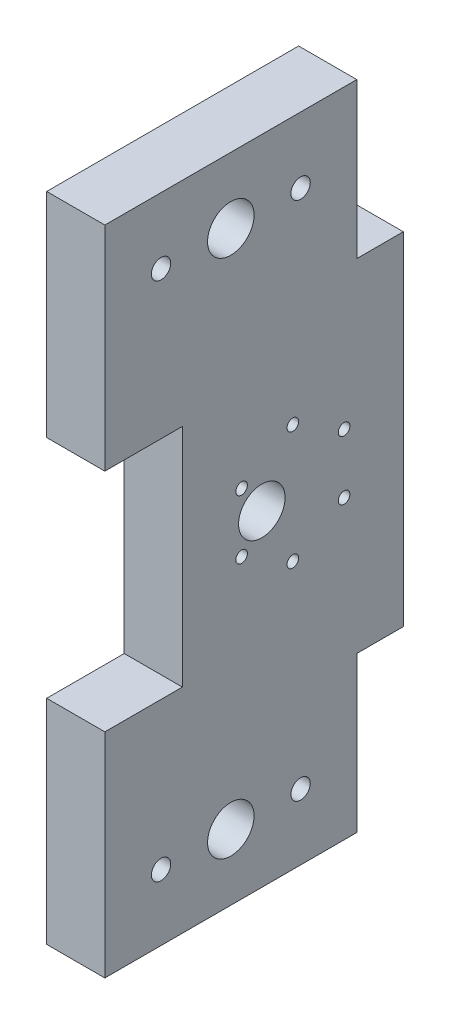
ISO-10303-21;
HEADER;
FILE_DESCRIPTION(('STEP AP214'),'2;1');
FILE_NAME('part.step','',(''),(''),'','','');
FILE_SCHEMA(('AUTOMOTIVE_DESIGN { 1 0 10303 214 1 1 1 1 }'));
ENDSEC;
DATA;
#1=APPLICATION_CONTEXT('core data for automotive mechanical design processes');
#2=APPLICATION_PROTOCOL_DEFINITION('international standard','automotive_design',2000,#1);
#3=PRODUCT_CONTEXT('',#1,'mechanical');
#4=PRODUCT('Part','Part','',(#3));
#5=PRODUCT_RELATED_PRODUCT_CATEGORY('part','',(#4));
#6=PRODUCT_DEFINITION_FORMATION('','',#4);
#7=PRODUCT_DEFINITION_CONTEXT('part definition',#1,'design');
#8=PRODUCT_DEFINITION('design','',#6,#7);
#9=PRODUCT_DEFINITION_SHAPE('','',#8);
#10=(LENGTH_UNIT() NAMED_UNIT(*) SI_UNIT(.MILLI.,.METRE.));
#11=(NAMED_UNIT(*) PLANE_ANGLE_UNIT() SI_UNIT($,.RADIAN.));
#12=(NAMED_UNIT(*) SI_UNIT($,.STERADIAN.) SOLID_ANGLE_UNIT());
#13=UNCERTAINTY_MEASURE_WITH_UNIT(LENGTH_MEASURE(1.E-05),#10,'distance_accuracy_value','');
#14=(GEOMETRIC_REPRESENTATION_CONTEXT(3) GLOBAL_UNCERTAINTY_ASSIGNED_CONTEXT((#13)) GLOBAL_UNIT_ASSIGNED_CONTEXT((#10,
#11,#12)) REPRESENTATION_CONTEXT('',''));
#15=CARTESIAN_POINT('',(0.,0.,0.));
#16=DIRECTION('',(0.,0.,1.));
#17=DIRECTION('',(1.,0.,0.));
#18=AXIS2_PLACEMENT_3D('',#15,#16,#17);
#19=CARTESIAN_POINT('',(0.,9.12000000000002,0.));
#20=DIRECTION('',(0.,1.,0.));
#21=DIRECTION('',(0.,0.,1.));
#22=AXIS2_PLACEMENT_3D('',#19,#20,#21);
#23=PLANE('',#22);
#24=DIRECTION('',(0.,0.,1.));
#25=VECTOR('',#24,1.);
#26=CARTESIAN_POINT('',(19.,9.12000000000001,-24.));
#27=LINE('',#26,#25);
#28=CARTESIAN_POINT('',(19.,9.12000000000001,-24.));
#29=VERTEX_POINT('',#28);
#30=CARTESIAN_POINT('',(19.,9.12000000000003,-12.));
#31=VERTEX_POINT('',#30);
#32=EDGE_CURVE('E212',#29,#31,#27,.T.);
#33=ORIENTED_EDGE('',*,*,#32,.T.);
#34=DIRECTION('',(1.,0.,0.));
#35=VECTOR('',#34,1.);
#36=CARTESIAN_POINT('',(19.,9.12000000000003,-12.));
#37=LINE('',#36,#35);
#38=CARTESIAN_POINT('',(34.,9.12000000000001,-12.));
#39=VERTEX_POINT('',#38);
#40=EDGE_CURVE('E157',#31,#39,#37,.T.);
#41=ORIENTED_EDGE('',*,*,#40,.T.);
#42=DIRECTION('',(0.,0.,-1.));
#43=VECTOR('',#42,1.);
#44=CARTESIAN_POINT('',(34.,9.12000000000001,-24.));
#45=LINE('',#44,#43);
#46=CARTESIAN_POINT('',(34.,9.12000000000001,-24.));
#47=VERTEX_POINT('',#46);
#48=EDGE_CURVE('E215',#39,#47,#45,.T.);
#49=ORIENTED_EDGE('',*,*,#48,.T.);
#50=DIRECTION('',(-1.,0.,0.));
#51=VECTOR('',#50,1.);
#52=CARTESIAN_POINT('',(19.,9.12000000000001,-24.));
#53=LINE('',#52,#51);
#54=EDGE_CURVE('E217',#47,#29,#53,.T.);
#55=ORIENTED_EDGE('',*,*,#54,.T.);
#56=EDGE_LOOP('',(#33,#41,#49,#55));
#57=FACE_BOUND('',#56,.T.);
#58=ADVANCED_FACE('F43',(#57),#23,.T.);
#59=CARTESIAN_POINT('',(19.,0.,33.));
#60=DIRECTION('',(0.,0.,1.));
#61=DIRECTION('',(0.,-1.,0.));
#62=AXIS2_PLACEMENT_3D('',#59,#60,#61);
#63=PLANE('',#62);
#64=DIRECTION('',(0.,-1.,0.));
#65=VECTOR('',#64,1.);
#66=CARTESIAN_POINT('',(19.,0.,33.));
#67=LINE('',#66,#65);
#68=CARTESIAN_POINT('',(19.,-5.87999999999998,33.));
#69=VERTEX_POINT('',#68);
#70=CARTESIAN_POINT('',(19.,-64.12,33.));
#71=VERTEX_POINT('',#70);
#72=EDGE_CURVE('E227',#69,#71,#67,.T.);
#73=ORIENTED_EDGE('',*,*,#72,.T.);
#74=DIRECTION('',(-1.,0.,0.));
#75=VECTOR('',#74,1.);
#76=CARTESIAN_POINT('',(19.,-64.12,33.));
#77=LINE('',#76,#75);
#78=CARTESIAN_POINT('',(34.,-64.12,33.));
#79=VERTEX_POINT('',#78);
#80=EDGE_CURVE('E197',#79,#71,#77,.T.);
#81=ORIENTED_EDGE('',*,*,#80,.F.);
#82=DIRECTION('',(0.,-1.,0.));
#83=VECTOR('',#82,1.);
#84=CARTESIAN_POINT('',(34.,0.,33.));
#85=LINE('',#84,#83);
#86=CARTESIAN_POINT('',(34.,-5.87999999999998,33.));
#87=VERTEX_POINT('',#86);
#88=EDGE_CURVE('E228',#87,#79,#85,.T.);
#89=ORIENTED_EDGE('',*,*,#88,.F.);
#90=DIRECTION('',(1.,0.,0.));
#91=VECTOR('',#90,1.);
#92=CARTESIAN_POINT('',(19.,-5.87999999999998,33.));
#93=LINE('',#92,#91);
#94=EDGE_CURVE('E148',#69,#87,#93,.T.);
#95=ORIENTED_EDGE('',*,*,#94,.F.);
#96=EDGE_LOOP('',(#73,#81,#89,#95));
#97=FACE_BOUND('',#96,.T.);
#98=ADVANCED_FACE('F293',(#97),#63,.T.);
#99=CARTESIAN_POINT('',(34.,-105.,25.));
#100=DIRECTION('',(-1.,0.,0.));
#101=DIRECTION('',(0.,0.,1.));
#102=AXIS2_PLACEMENT_3D('',#99,#100,#101);
#103=PLANE('',#102);
#104=CARTESIAN_POINT('',(34.,-102.12,2.50000000000001));
#105=DIRECTION('',(-1.,0.,0.));
#106=DIRECTION('',(0.,-1.,0.));
#107=AXIS2_PLACEMENT_3D('',#104,#105,#106);
#108=CIRCLE('',#107,2.5);
#109=CARTESIAN_POINT('',(34.,-104.62,2.50000000000001));
#110=VERTEX_POINT('',#109);
#111=EDGE_CURVE('E424',#110,#110,#108,.T.);
#112=ORIENTED_EDGE('',*,*,#111,.T.);
#113=EDGE_LOOP('',(#112));
#114=FACE_BOUND('',#113,.T.);
#115=CARTESIAN_POINT('',(34.,-102.12,38.5));
#116=DIRECTION('',(-1.,0.,0.));
#117=DIRECTION('',(0.,1.,0.));
#118=AXIS2_PLACEMENT_3D('',#115,#116,#117);
#119=CIRCLE('',#118,2.50000000000001);
#120=CARTESIAN_POINT('',(34.,-99.6199999999999,38.5));
#121=VERTEX_POINT('',#120);
#122=EDGE_CURVE('E430',#121,#121,#119,.T.);
#123=ORIENTED_EDGE('',*,*,#122,.T.);
#124=EDGE_LOOP('',(#123));
#125=FACE_BOUND('',#124,.T.);
#126=CARTESIAN_POINT('',(34.,32.12,38.5));
#127=DIRECTION('',(-1.,0.,0.));
#128=DIRECTION('',(0.,-1.,0.));
#129=AXIS2_PLACEMENT_3D('',#126,#127,#128);
#130=CIRCLE('',#129,2.50000000000001);
#131=CARTESIAN_POINT('',(34.,29.62,38.5));
#132=VERTEX_POINT('',#131);
#133=EDGE_CURVE('E436',#132,#132,#130,.T.);
#134=ORIENTED_EDGE('',*,*,#133,.T.);
#135=EDGE_LOOP('',(#134));
#136=FACE_BOUND('',#135,.T.);
#137=CARTESIAN_POINT('',(34.,32.12,20.5));
#138=DIRECTION('',(-1.,0.,0.));
#139=DIRECTION('',(0.,1.,0.));
#140=AXIS2_PLACEMENT_3D('',#137,#138,#139);
#141=CIRCLE('',#140,6.);
#142=CARTESIAN_POINT('',(34.,38.12,20.5));
#143=VERTEX_POINT('',#142);
#144=EDGE_CURVE('E413',#143,#143,#141,.T.);
#145=ORIENTED_EDGE('',*,*,#144,.T.);
#146=EDGE_LOOP('',(#145));
#147=FACE_BOUND('',#146,.T.);
#148=CARTESIAN_POINT('',(34.,32.12,2.49999999999998));
#149=DIRECTION('',(-1.,0.,0.));
#150=DIRECTION('',(0.,1.,0.));
#151=AXIS2_PLACEMENT_3D('',#148,#149,#150);
#152=CIRCLE('',#151,2.5);
#153=CARTESIAN_POINT('',(34.,34.62,2.49999999999998));
#154=VERTEX_POINT('',#153);
#155=EDGE_CURVE('E408',#154,#154,#152,.T.);
#156=ORIENTED_EDGE('',*,*,#155,.T.);
#157=EDGE_LOOP('',(#156));
#158=FACE_BOUND('',#157,.T.);
#159=CARTESIAN_POINT('',(34.,-102.12,20.5));
#160=DIRECTION('',(-1.,0.,0.));
#161=DIRECTION('',(0.,-1.,0.));
#162=AXIS2_PLACEMENT_3D('',#159,#160,#161);
#163=CIRCLE('',#162,6.);
#164=CARTESIAN_POINT('',(34.,-108.12,20.5));
#165=VERTEX_POINT('',#164);
#166=EDGE_CURVE('E170',#165,#165,#163,.T.);
#167=ORIENTED_EDGE('',*,*,#166,.T.);
#168=EDGE_LOOP('',(#167));
#169=FACE_BOUND('',#168,.T.);
#170=CARTESIAN_POINT('',(34.,-27.3675,17.7198777887694));
#171=DIRECTION('',(1.,0.,0.));
#172=DIRECTION('',(0.,0.,-1.));
#173=AXIS2_PLACEMENT_3D('',#170,#171,#172);
#174=CIRCLE('',#173,1.5);
#175=CARTESIAN_POINT('',(34.,-27.3675,16.2198777887694));
#176=VERTEX_POINT('',#175);
#177=EDGE_CURVE('E236',#176,#176,#174,.T.);
#178=ORIENTED_EDGE('',*,*,#177,.F.);
#179=EDGE_LOOP('',(#178));
#180=FACE_BOUND('',#179,.T.);
#181=CARTESIAN_POINT('',(34.,-35.,12.5));
#182=DIRECTION('',(1.,0.,0.));
#183=DIRECTION('',(0.,0.,-1.));
#184=AXIS2_PLACEMENT_3D('',#181,#182,#183);
#185=CIRCLE('',#184,6.00000000000001);
#186=CARTESIAN_POINT('',(34.,-35.,6.49999999999998));
#187=VERTEX_POINT('',#186);
#188=EDGE_CURVE('E11',#187,#187,#185,.T.);
#189=ORIENTED_EDGE('',*,*,#188,.F.);
#190=EDGE_LOOP('',(#189));
#191=FACE_BOUND('',#190,.T.);
#192=CARTESIAN_POINT('',(34.,-19.735,4.49999999999999));
#193=DIRECTION('',(1.,0.,0.));
#194=DIRECTION('',(0.,0.,-1.));
#195=AXIS2_PLACEMENT_3D('',#192,#193,#194);
#196=CIRCLE('',#195,1.5);
#197=CARTESIAN_POINT('',(34.,-19.735,2.99999999999999));
#198=VERTEX_POINT('',#197);
#199=EDGE_CURVE('E268',#198,#198,#196,.T.);
#200=ORIENTED_EDGE('',*,*,#199,.F.);
#201=EDGE_LOOP('',(#200));
#202=FACE_BOUND('',#201,.T.);
#203=CARTESIAN_POINT('',(34.,-42.6325,17.7198777887694));
#204=DIRECTION('',(1.,0.,0.));
#205=DIRECTION('',(0.,0.,-1.));
#206=AXIS2_PLACEMENT_3D('',#203,#204,#205);
#207=CIRCLE('',#206,1.5);
#208=CARTESIAN_POINT('',(34.,-42.6325,16.2198777887694));
#209=VERTEX_POINT('',#208);
#210=EDGE_CURVE('E244',#209,#209,#207,.T.);
#211=ORIENTED_EDGE('',*,*,#210,.F.);
#212=EDGE_LOOP('',(#211));
#213=FACE_BOUND('',#212,.T.);
#214=CARTESIAN_POINT('',(34.,-50.265,4.49999999999999));
#215=DIRECTION('',(1.,0.,0.));
#216=DIRECTION('',(0.,0.,-1.));
#217=AXIS2_PLACEMENT_3D('',#214,#215,#216);
#218=CIRCLE('',#217,1.5);
#219=CARTESIAN_POINT('',(34.,-50.265,2.99999999999998));
#220=VERTEX_POINT('',#219);
#221=EDGE_CURVE('E250',#220,#220,#218,.T.);
#222=ORIENTED_EDGE('',*,*,#221,.F.);
#223=EDGE_LOOP('',(#222));
#224=FACE_BOUND('',#223,.T.);
#225=CARTESIAN_POINT('',(34.,-42.6325,-8.71987778876947));
#226=DIRECTION('',(1.,0.,0.));
#227=DIRECTION('',(0.,0.,-1.));
#228=AXIS2_PLACEMENT_3D('',#225,#226,#227);
#229=CIRCLE('',#228,1.5);
#230=CARTESIAN_POINT('',(34.,-42.6325,-10.2198777887695));
#231=VERTEX_POINT('',#230);
#232=EDGE_CURVE('E256',#231,#231,#229,.T.);
#233=ORIENTED_EDGE('',*,*,#232,.F.);
#234=EDGE_LOOP('',(#233));
#235=FACE_BOUND('',#234,.T.);
#236=CARTESIAN_POINT('',(34.,-27.3675,-8.71987778876947));
#237=DIRECTION('',(1.,0.,0.));
#238=DIRECTION('',(0.,0.,-1.));
#239=AXIS2_PLACEMENT_3D('',#236,#237,#238);
#240=CIRCLE('',#239,1.5);
#241=CARTESIAN_POINT('',(34.,-27.3675,-10.2198777887695));
#242=VERTEX_POINT('',#241);
#243=EDGE_CURVE('E262',#242,#242,#240,.T.);
#244=ORIENTED_EDGE('',*,*,#243,.F.);
#245=EDGE_LOOP('',(#244));
#246=FACE_BOUND('',#245,.T.);
#247=ORIENTED_EDGE('',*,*,#48,.F.);
#248=DIRECTION('',(0.,-1.,0.));
#249=VECTOR('',#248,1.);
#250=CARTESIAN_POINT('',(34.,49.12,-12.));
#251=LINE('',#250,#249);
#252=CARTESIAN_POINT('',(34.,49.12,-12.));
#253=VERTEX_POINT('',#252);
#254=EDGE_CURVE('E60',#253,#39,#251,.T.);
#255=ORIENTED_EDGE('',*,*,#254,.F.);
#256=DIRECTION('',(0.,0.,1.));
#257=VECTOR('',#256,1.);
#258=CARTESIAN_POINT('',(34.,49.12,53.));
#259=LINE('',#258,#257);
#260=CARTESIAN_POINT('',(34.,49.12,53.));
#261=VERTEX_POINT('',#260);
#262=EDGE_CURVE('E162',#253,#261,#259,.T.);
#263=ORIENTED_EDGE('',*,*,#262,.T.);
#264=DIRECTION('',(0.,1.,0.));
#265=VECTOR('',#264,1.);
#266=CARTESIAN_POINT('',(34.,9.12000000000002,53.));
#267=LINE('',#266,#265);
#268=CARTESIAN_POINT('',(34.,-5.87999999999998,53.));
#269=VERTEX_POINT('',#268);
#270=EDGE_CURVE('E161',#269,#261,#267,.T.);
#271=ORIENTED_EDGE('',*,*,#270,.F.);
#272=DIRECTION('',(0.,0.,-1.));
#273=VECTOR('',#272,1.);
#274=CARTESIAN_POINT('',(34.,-5.87999999999998,53.));
#275=LINE('',#274,#273);
#276=EDGE_CURVE('E206',#269,#87,#275,.T.);
#277=ORIENTED_EDGE('',*,*,#276,.T.);
#278=ORIENTED_EDGE('',*,*,#88,.T.);
#279=DIRECTION('',(0.,0.,-1.));
#280=VECTOR('',#279,1.);
#281=CARTESIAN_POINT('',(34.,-64.12,53.));
#282=LINE('',#281,#280);
#283=CARTESIAN_POINT('',(34.,-64.12,53.));
#284=VERTEX_POINT('',#283);
#285=EDGE_CURVE('E191',#284,#79,#282,.T.);
#286=ORIENTED_EDGE('',*,*,#285,.F.);
#287=DIRECTION('',(0.,1.,0.));
#288=VECTOR('',#287,1.);
#289=CARTESIAN_POINT('',(34.,-79.12,53.));
#290=LINE('',#289,#288);
#291=CARTESIAN_POINT('',(34.,-119.12,53.));
#292=VERTEX_POINT('',#291);
#293=EDGE_CURVE('E201',#292,#284,#290,.T.);
#294=ORIENTED_EDGE('',*,*,#293,.F.);
#295=DIRECTION('',(0.,0.,1.));
#296=VECTOR('',#295,1.);
#297=CARTESIAN_POINT('',(34.,-119.12,53.));
#298=LINE('',#297,#296);
#299=CARTESIAN_POINT('',(34.,-119.12,-12.));
#300=VERTEX_POINT('',#299);
#301=EDGE_CURVE('E178',#300,#292,#298,.T.);
#302=ORIENTED_EDGE('',*,*,#301,.F.);
#303=DIRECTION('',(0.,1.,0.));
#304=VECTOR('',#303,1.);
#305=CARTESIAN_POINT('',(34.,-119.12,-12.));
#306=LINE('',#305,#304);
#307=CARTESIAN_POINT('',(34.,-79.12,-12.));
#308=VERTEX_POINT('',#307);
#309=EDGE_CURVE('E184',#300,#308,#306,.T.);
#310=ORIENTED_EDGE('',*,*,#309,.T.);
#311=DIRECTION('',(0.,0.,1.));
#312=VECTOR('',#311,1.);
#313=CARTESIAN_POINT('',(34.,-79.12,33.));
#314=LINE('',#313,#312);
#315=CARTESIAN_POINT('',(34.,-79.12,-24.));
#316=VERTEX_POINT('',#315);
#317=EDGE_CURVE('E225',#316,#308,#314,.T.);
#318=ORIENTED_EDGE('',*,*,#317,.F.);
#319=DIRECTION('',(0.,-1.,0.));
#320=VECTOR('',#319,1.);
#321=CARTESIAN_POINT('',(34.,0.,-24.));
#322=LINE('',#321,#320);
#323=EDGE_CURVE('E234',#47,#316,#322,.T.);
#324=ORIENTED_EDGE('',*,*,#323,.F.);
#325=EDGE_LOOP('',(#247,#255,#263,#271,#277,#278,#286,#294,#302,#310,#318,#324));
#326=FACE_BOUND('',#325,.T.);
#327=ADVANCED_FACE('F45',(#114,#125,#136,#147,#158,#169,#180,#191,#202,#213,#224,#235,#246,
#326),#103,.F.);
#328=CARTESIAN_POINT('',(-17.001,-27.3675,-8.71987778876947));
#329=DIRECTION('',(1.,0.,0.));
#330=DIRECTION('',(0.,0.,-1.));
#331=AXIS2_PLACEMENT_3D('',#328,#329,#330);
#332=CYLINDRICAL_SURFACE('',#331,1.5);
#333=CARTESIAN_POINT('',(19.,-27.3675,-8.71987778876947));
#334=DIRECTION('',(-1.,0.,0.));
#335=DIRECTION('',(0.,-1.,0.));
#336=AXIS2_PLACEMENT_3D('',#333,#334,#335);
#337=CIRCLE('',#336,1.5);
#338=CARTESIAN_POINT('',(19.,-28.8675,-8.71987778876947));
#339=VERTEX_POINT('',#338);
#340=EDGE_CURVE('E241',#339,#339,#337,.F.);
#341=ORIENTED_EDGE('',*,*,#340,.F.);
#342=EDGE_LOOP('',(#341));
#343=FACE_BOUND('',#342,.T.);
#344=ORIENTED_EDGE('',*,*,#243,.T.);
#345=EDGE_LOOP('',(#344));
#346=FACE_BOUND('',#345,.T.);
#347=ADVANCED_FACE('F323',(#343,#346),#332,.F.);
#348=CARTESIAN_POINT('',(-17.001,-42.6325,-8.71987778876947));
#349=DIRECTION('',(1.,0.,0.));
#350=DIRECTION('',(0.,0.,-1.));
#351=AXIS2_PLACEMENT_3D('',#348,#349,#350);
#352=CYLINDRICAL_SURFACE('',#351,1.5);
#353=CARTESIAN_POINT('',(19.,-42.6325,-8.71987778876947));
#354=DIRECTION('',(-1.,0.,0.));
#355=DIRECTION('',(0.,-1.,0.));
#356=AXIS2_PLACEMENT_3D('',#353,#354,#355);
#357=CIRCLE('',#356,1.5);
#358=CARTESIAN_POINT('',(19.,-44.1325,-8.71987778876947));
#359=VERTEX_POINT('',#358);
#360=EDGE_CURVE('E259',#359,#359,#357,.F.);
#361=ORIENTED_EDGE('',*,*,#360,.F.);
#362=EDGE_LOOP('',(#361));
#363=FACE_BOUND('',#362,.T.);
#364=ORIENTED_EDGE('',*,*,#232,.T.);
#365=EDGE_LOOP('',(#364));
#366=FACE_BOUND('',#365,.T.);
#367=ADVANCED_FACE('F319',(#363,#366),#352,.F.);
#368=CARTESIAN_POINT('',(-17.001,-50.265,4.49999999999999));
#369=DIRECTION('',(1.,0.,0.));
#370=DIRECTION('',(0.,0.,-1.));
#371=AXIS2_PLACEMENT_3D('',#368,#369,#370);
#372=CYLINDRICAL_SURFACE('',#371,1.5);
#373=CARTESIAN_POINT('',(19.,-50.265,4.49999999999999));
#374=DIRECTION('',(-1.,0.,0.));
#375=DIRECTION('',(0.,-1.,0.));
#376=AXIS2_PLACEMENT_3D('',#373,#374,#375);
#377=CIRCLE('',#376,1.5);
#378=CARTESIAN_POINT('',(19.,-51.765,4.49999999999999));
#379=VERTEX_POINT('',#378);
#380=EDGE_CURVE('E253',#379,#379,#377,.F.);
#381=ORIENTED_EDGE('',*,*,#380,.F.);
#382=EDGE_LOOP('',(#381));
#383=FACE_BOUND('',#382,.T.);
#384=ORIENTED_EDGE('',*,*,#221,.T.);
#385=EDGE_LOOP('',(#384));
#386=FACE_BOUND('',#385,.T.);
#387=ADVANCED_FACE('F289',(#383,#386),#372,.F.);
#388=CARTESIAN_POINT('',(-17.001,-42.6325,17.7198777887694));
#389=DIRECTION('',(1.,0.,0.));
#390=DIRECTION('',(0.,0.,-1.));
#391=AXIS2_PLACEMENT_3D('',#388,#389,#390);
#392=CYLINDRICAL_SURFACE('',#391,1.5);
#393=CARTESIAN_POINT('',(19.,-42.6325,17.7198777887694));
#394=DIRECTION('',(-1.,0.,0.));
#395=DIRECTION('',(0.,-1.,0.));
#396=AXIS2_PLACEMENT_3D('',#393,#394,#395);
#397=CIRCLE('',#396,1.5);
#398=CARTESIAN_POINT('',(19.,-44.1325,17.7198777887694));
#399=VERTEX_POINT('',#398);
#400=EDGE_CURVE('E247',#399,#399,#397,.F.);
#401=ORIENTED_EDGE('',*,*,#400,.F.);
#402=EDGE_LOOP('',(#401));
#403=FACE_BOUND('',#402,.T.);
#404=ORIENTED_EDGE('',*,*,#210,.T.);
#405=EDGE_LOOP('',(#404));
#406=FACE_BOUND('',#405,.T.);
#407=ADVANCED_FACE('F280',(#403,#406),#392,.F.);
#408=CARTESIAN_POINT('',(-17.001,-19.735,4.49999999999999));
#409=DIRECTION('',(1.,0.,0.));
#410=DIRECTION('',(0.,0.,-1.));
#411=AXIS2_PLACEMENT_3D('',#408,#409,#410);
#412=CYLINDRICAL_SURFACE('',#411,1.5);
#413=CARTESIAN_POINT('',(19.,-19.735,4.49999999999999));
#414=DIRECTION('',(-1.,0.,0.));
#415=DIRECTION('',(0.,-1.,0.));
#416=AXIS2_PLACEMENT_3D('',#413,#414,#415);
#417=CIRCLE('',#416,1.5);
#418=CARTESIAN_POINT('',(19.,-21.235,4.49999999999999));
#419=VERTEX_POINT('',#418);
#420=EDGE_CURVE('E47',#419,#419,#417,.F.);
#421=ORIENTED_EDGE('',*,*,#420,.F.);
#422=EDGE_LOOP('',(#421));
#423=FACE_BOUND('',#422,.T.);
#424=ORIENTED_EDGE('',*,*,#199,.T.);
#425=EDGE_LOOP('',(#424));
#426=FACE_BOUND('',#425,.T.);
#427=ADVANCED_FACE('F277',(#423,#426),#412,.F.);
#428=CARTESIAN_POINT('',(-17.001,-35.,12.5));
#429=DIRECTION('',(1.,0.,0.));
#430=DIRECTION('',(0.,0.,-1.));
#431=AXIS2_PLACEMENT_3D('',#428,#429,#430);
#432=CYLINDRICAL_SURFACE('',#431,6.00000000000001);
#433=CARTESIAN_POINT('',(19.,-35.,12.5));
#434=DIRECTION('',(-1.,0.,0.));
#435=DIRECTION('',(0.,-1.,0.));
#436=AXIS2_PLACEMENT_3D('',#433,#434,#435);
#437=CIRCLE('',#436,6.00000000000001);
#438=CARTESIAN_POINT('',(19.,-41.,12.5));
#439=VERTEX_POINT('',#438);
#440=EDGE_CURVE('E52',#439,#439,#437,.F.);
#441=ORIENTED_EDGE('',*,*,#440,.F.);
#442=EDGE_LOOP('',(#441));
#443=FACE_BOUND('',#442,.T.);
#444=ORIENTED_EDGE('',*,*,#188,.T.);
#445=EDGE_LOOP('',(#444));
#446=FACE_BOUND('',#445,.T.);
#447=ADVANCED_FACE('F279',(#443,#446),#432,.F.);
#448=CARTESIAN_POINT('',(-17.001,-27.3675,17.7198777887694));
#449=DIRECTION('',(1.,0.,0.));
#450=DIRECTION('',(0.,0.,-1.));
#451=AXIS2_PLACEMENT_3D('',#448,#449,#450);
#452=CYLINDRICAL_SURFACE('',#451,1.5);
#453=CARTESIAN_POINT('',(19.,-27.3675,17.7198777887694));
#454=DIRECTION('',(-1.,0.,0.));
#455=DIRECTION('',(0.,-1.,0.));
#456=AXIS2_PLACEMENT_3D('',#453,#454,#455);
#457=CIRCLE('',#456,1.5);
#458=CARTESIAN_POINT('',(19.,-28.8675,17.7198777887694));
#459=VERTEX_POINT('',#458);
#460=EDGE_CURVE('E238',#459,#459,#457,.F.);
#461=ORIENTED_EDGE('',*,*,#460,.F.);
#462=EDGE_LOOP('',(#461));
#463=FACE_BOUND('',#462,.T.);
#464=ORIENTED_EDGE('',*,*,#177,.T.);
#465=EDGE_LOOP('',(#464));
#466=FACE_BOUND('',#465,.T.);
#467=ADVANCED_FACE('F286',(#463,#466),#452,.F.);
#468=CARTESIAN_POINT('',(19.,0.,-24.));
#469=DIRECTION('',(0.,0.,1.));
#470=DIRECTION('',(0.,-1.,0.));
#471=AXIS2_PLACEMENT_3D('',#468,#469,#470);
#472=PLANE('',#471);
#473=ORIENTED_EDGE('',*,*,#323,.T.);
#474=DIRECTION('',(1.,0.,0.));
#475=VECTOR('',#474,1.);
#476=CARTESIAN_POINT('',(19.,-79.12,-24.));
#477=LINE('',#476,#475);
#478=CARTESIAN_POINT('',(19.,-79.12,-24.));
#479=VERTEX_POINT('',#478);
#480=EDGE_CURVE('E222',#479,#316,#477,.T.);
#481=ORIENTED_EDGE('',*,*,#480,.F.);
#482=DIRECTION('',(0.,-1.,0.));
#483=VECTOR('',#482,1.);
#484=CARTESIAN_POINT('',(19.,0.,-24.));
#485=LINE('',#484,#483);
#486=EDGE_CURVE('E231',#29,#479,#485,.T.);
#487=ORIENTED_EDGE('',*,*,#486,.F.);
#488=ORIENTED_EDGE('',*,*,#54,.F.);
#489=EDGE_LOOP('',(#473,#481,#487,#488));
#490=FACE_BOUND('',#489,.T.);
#491=ADVANCED_FACE('F309',(#490),#472,.F.);
#492=CARTESIAN_POINT('',(19.,0.,25.));
#493=DIRECTION('',(-1.,0.,0.));
#494=DIRECTION('',(0.,-1.,0.));
#495=AXIS2_PLACEMENT_3D('',#492,#493,#494);
#496=PLANE('',#495);
#497=CARTESIAN_POINT('',(19.,-102.12,2.50000000000001));
#498=DIRECTION('',(-1.,0.,0.));
#499=DIRECTION('',(0.,-1.,0.));
#500=AXIS2_PLACEMENT_3D('',#497,#498,#499);
#501=CIRCLE('',#500,2.5);
#502=CARTESIAN_POINT('',(19.,-104.62,2.50000000000001));
#503=VERTEX_POINT('',#502);
#504=EDGE_CURVE('E420',#503,#503,#501,.T.);
#505=ORIENTED_EDGE('',*,*,#504,.F.);
#506=EDGE_LOOP('',(#505));
#507=FACE_BOUND('',#506,.T.);
#508=CARTESIAN_POINT('',(19.,-102.12,38.5));
#509=DIRECTION('',(-1.,0.,0.));
#510=DIRECTION('',(0.,1.,0.));
#511=AXIS2_PLACEMENT_3D('',#508,#509,#510);
#512=CIRCLE('',#511,2.50000000000001);
#513=CARTESIAN_POINT('',(19.,-99.6199999999999,38.5));
#514=VERTEX_POINT('',#513);
#515=EDGE_CURVE('E427',#514,#514,#512,.T.);
#516=ORIENTED_EDGE('',*,*,#515,.F.);
#517=EDGE_LOOP('',(#516));
#518=FACE_BOUND('',#517,.T.);
#519=CARTESIAN_POINT('',(19.,32.12,38.5));
#520=DIRECTION('',(-1.,0.,0.));
#521=DIRECTION('',(0.,-1.,0.));
#522=AXIS2_PLACEMENT_3D('',#519,#520,#521);
#523=CIRCLE('',#522,2.50000000000001);
#524=CARTESIAN_POINT('',(19.,29.62,38.5));
#525=VERTEX_POINT('',#524);
#526=EDGE_CURVE('E433',#525,#525,#523,.T.);
#527=ORIENTED_EDGE('',*,*,#526,.F.);
#528=EDGE_LOOP('',(#527));
#529=FACE_BOUND('',#528,.T.);
#530=CARTESIAN_POINT('',(19.,32.12,20.5));
#531=DIRECTION('',(-1.,0.,0.));
#532=DIRECTION('',(0.,1.,0.));
#533=AXIS2_PLACEMENT_3D('',#530,#531,#532);
#534=CIRCLE('',#533,6.);
#535=CARTESIAN_POINT('',(19.,38.12,20.5));
#536=VERTEX_POINT('',#535);
#537=EDGE_CURVE('E416',#536,#536,#534,.T.);
#538=ORIENTED_EDGE('',*,*,#537,.F.);
#539=EDGE_LOOP('',(#538));
#540=FACE_BOUND('',#539,.T.);
#541=CARTESIAN_POINT('',(19.,32.12,2.49999999999998));
#542=DIRECTION('',(-1.,0.,0.));
#543=DIRECTION('',(0.,1.,0.));
#544=AXIS2_PLACEMENT_3D('',#541,#542,#543);
#545=CIRCLE('',#544,2.5);
#546=CARTESIAN_POINT('',(19.,34.62,2.49999999999998));
#547=VERTEX_POINT('',#546);
#548=EDGE_CURVE('E411',#547,#547,#545,.T.);
#549=ORIENTED_EDGE('',*,*,#548,.F.);
#550=EDGE_LOOP('',(#549));
#551=FACE_BOUND('',#550,.T.);
#552=CARTESIAN_POINT('',(19.,-102.12,20.5));
#553=DIRECTION('',(-1.,0.,0.));
#554=DIRECTION('',(0.,-1.,0.));
#555=AXIS2_PLACEMENT_3D('',#552,#553,#554);
#556=CIRCLE('',#555,6.);
#557=CARTESIAN_POINT('',(19.,-108.12,20.5));
#558=VERTEX_POINT('',#557);
#559=EDGE_CURVE('E423',#558,#558,#556,.T.);
#560=ORIENTED_EDGE('',*,*,#559,.F.);
#561=EDGE_LOOP('',(#560));
#562=FACE_BOUND('',#561,.T.);
#563=ORIENTED_EDGE('',*,*,#340,.T.);
#564=EDGE_LOOP('',(#563));
#565=FACE_BOUND('',#564,.T.);
#566=ORIENTED_EDGE('',*,*,#360,.T.);
#567=EDGE_LOOP('',(#566));
#568=FACE_BOUND('',#567,.T.);
#569=ORIENTED_EDGE('',*,*,#380,.T.);
#570=EDGE_LOOP('',(#569));
#571=FACE_BOUND('',#570,.T.);
#572=ORIENTED_EDGE('',*,*,#400,.T.);
#573=EDGE_LOOP('',(#572));
#574=FACE_BOUND('',#573,.T.);
#575=ORIENTED_EDGE('',*,*,#420,.T.);
#576=EDGE_LOOP('',(#575));
#577=FACE_BOUND('',#576,.T.);
#578=ORIENTED_EDGE('',*,*,#440,.T.);
#579=EDGE_LOOP('',(#578));
#580=FACE_BOUND('',#579,.T.);
#581=ORIENTED_EDGE('',*,*,#460,.T.);
#582=EDGE_LOOP('',(#581));
#583=FACE_BOUND('',#582,.T.);
#584=ORIENTED_EDGE('',*,*,#486,.T.);
#585=DIRECTION('',(0.,0.,-1.));
#586=VECTOR('',#585,1.);
#587=CARTESIAN_POINT('',(19.,-79.12,33.));
#588=LINE('',#587,#586);
#589=CARTESIAN_POINT('',(19.,-79.12,-12.));
#590=VERTEX_POINT('',#589);
#591=EDGE_CURVE('E220',#590,#479,#588,.T.);
#592=ORIENTED_EDGE('',*,*,#591,.F.);
#593=DIRECTION('',(0.,1.,0.));
#594=VECTOR('',#593,1.);
#595=CARTESIAN_POINT('',(19.,-119.12,-12.));
#596=LINE('',#595,#594);
#597=CARTESIAN_POINT('',(19.,-119.12,-12.));
#598=VERTEX_POINT('',#597);
#599=EDGE_CURVE('E188',#598,#590,#596,.T.);
#600=ORIENTED_EDGE('',*,*,#599,.F.);
#601=DIRECTION('',(0.,0.,-1.));
#602=VECTOR('',#601,1.);
#603=CARTESIAN_POINT('',(19.,-119.12,53.));
#604=LINE('',#603,#602);
#605=CARTESIAN_POINT('',(19.,-119.12,53.));
#606=VERTEX_POINT('',#605);
#607=EDGE_CURVE('E173',#606,#598,#604,.T.);
#608=ORIENTED_EDGE('',*,*,#607,.F.);
#609=DIRECTION('',(0.,-1.,0.));
#610=VECTOR('',#609,1.);
#611=CARTESIAN_POINT('',(19.,-79.12,53.));
#612=LINE('',#611,#610);
#613=CARTESIAN_POINT('',(19.,-64.12,53.));
#614=VERTEX_POINT('',#613);
#615=EDGE_CURVE('E199',#614,#606,#612,.T.);
#616=ORIENTED_EDGE('',*,*,#615,.F.);
#617=DIRECTION('',(0.,0.,-1.));
#618=VECTOR('',#617,1.);
#619=CARTESIAN_POINT('',(19.,-64.12,53.));
#620=LINE('',#619,#618);
#621=EDGE_CURVE('E193',#614,#71,#620,.T.);
#622=ORIENTED_EDGE('',*,*,#621,.T.);
#623=ORIENTED_EDGE('',*,*,#72,.F.);
#624=DIRECTION('',(0.,0.,-1.));
#625=VECTOR('',#624,1.);
#626=CARTESIAN_POINT('',(19.,-5.87999999999998,53.));
#627=LINE('',#626,#625);
#628=CARTESIAN_POINT('',(19.,-5.87999999999998,53.));
#629=VERTEX_POINT('',#628);
#630=EDGE_CURVE('E144',#629,#69,#627,.T.);
#631=ORIENTED_EDGE('',*,*,#630,.F.);
#632=DIRECTION('',(0.,-1.,0.));
#633=VECTOR('',#632,1.);
#634=CARTESIAN_POINT('',(19.,9.12000000000002,53.));
#635=LINE('',#634,#633);
#636=CARTESIAN_POINT('',(19.,49.12,53.));
#637=VERTEX_POINT('',#636);
#638=EDGE_CURVE('E136',#637,#629,#635,.T.);
#639=ORIENTED_EDGE('',*,*,#638,.F.);
#640=DIRECTION('',(0.,0.,-1.));
#641=VECTOR('',#640,1.);
#642=CARTESIAN_POINT('',(19.,49.12,53.));
#643=LINE('',#642,#641);
#644=CARTESIAN_POINT('',(19.,49.12,-12.));
#645=VERTEX_POINT('',#644);
#646=EDGE_CURVE('E140',#637,#645,#643,.T.);
#647=ORIENTED_EDGE('',*,*,#646,.T.);
#648=DIRECTION('',(0.,-1.,0.));
#649=VECTOR('',#648,1.);
#650=CARTESIAN_POINT('',(19.,49.12,-12.));
#651=LINE('',#650,#649);
#652=EDGE_CURVE('E168',#645,#31,#651,.T.);
#653=ORIENTED_EDGE('',*,*,#652,.T.);
#654=ORIENTED_EDGE('',*,*,#32,.F.);
#655=EDGE_LOOP('',(#584,#592,#600,#608,#616,#622,#623,#631,#639,#647,#653,#654));
#656=FACE_BOUND('',#655,.T.);
#657=ADVANCED_FACE('F139',(#507,#518,#529,#540,#551,#562,#565,#568,#571,#574,#577,#580,#583,
#656),#496,.T.);
#658=CARTESIAN_POINT('',(0.,-79.12,0.));
#659=DIRECTION('',(0.,-1.,0.));
#660=DIRECTION('',(0.,0.,-1.));
#661=AXIS2_PLACEMENT_3D('',#658,#659,#660);
#662=PLANE('',#661);
#663=DIRECTION('',(1.,0.,0.));
#664=VECTOR('',#663,1.);
#665=CARTESIAN_POINT('',(19.,-79.12,-12.));
#666=LINE('',#665,#664);
#667=EDGE_CURVE('E68',#590,#308,#666,.T.);
#668=ORIENTED_EDGE('',*,*,#667,.F.);
#669=ORIENTED_EDGE('',*,*,#591,.T.);
#670=ORIENTED_EDGE('',*,*,#480,.T.);
#671=ORIENTED_EDGE('',*,*,#317,.T.);
#672=EDGE_LOOP('',(#668,#669,#670,#671));
#673=FACE_BOUND('',#672,.T.);
#674=ADVANCED_FACE('F307',(#673),#662,.T.);
#675=CARTESIAN_POINT('',(19.,-5.87999999999998,53.));
#676=DIRECTION('',(0.,1.,0.));
#677=DIRECTION('',(0.,0.,1.));
#678=AXIS2_PLACEMENT_3D('',#675,#676,#677);
#679=PLANE('',#678);
#680=ORIENTED_EDGE('',*,*,#94,.T.);
#681=ORIENTED_EDGE('',*,*,#276,.F.);
#682=DIRECTION('',(1.,0.,0.));
#683=VECTOR('',#682,1.);
#684=CARTESIAN_POINT('',(19.,-5.87999999999998,53.));
#685=LINE('',#684,#683);
#686=EDGE_CURVE('E147',#629,#269,#685,.T.);
#687=ORIENTED_EDGE('',*,*,#686,.F.);
#688=ORIENTED_EDGE('',*,*,#630,.T.);
#689=EDGE_LOOP('',(#680,#681,#687,#688));
#690=FACE_BOUND('',#689,.T.);
#691=ADVANCED_FACE('F305',(#690),#679,.F.);
#692=CARTESIAN_POINT('',(0.,0.,53.));
#693=DIRECTION('',(0.,0.,1.));
#694=DIRECTION('',(1.,0.,0.));
#695=AXIS2_PLACEMENT_3D('',#692,#693,#694);
#696=PLANE('',#695);
#697=ORIENTED_EDGE('',*,*,#638,.T.);
#698=ORIENTED_EDGE('',*,*,#686,.T.);
#699=ORIENTED_EDGE('',*,*,#270,.T.);
#700=DIRECTION('',(-1.,0.,0.));
#701=VECTOR('',#700,1.);
#702=CARTESIAN_POINT('',(19.,49.12,53.));
#703=LINE('',#702,#701);
#704=EDGE_CURVE('E154',#261,#637,#703,.T.);
#705=ORIENTED_EDGE('',*,*,#704,.T.);
#706=EDGE_LOOP('',(#697,#698,#699,#705));
#707=FACE_BOUND('',#706,.T.);
#708=ADVANCED_FACE('F159',(#707),#696,.T.);
#709=CARTESIAN_POINT('',(19.,-64.12,53.));
#710=DIRECTION('',(0.,-1.,0.));
#711=DIRECTION('',(0.,0.,-1.));
#712=AXIS2_PLACEMENT_3D('',#709,#710,#711);
#713=PLANE('',#712);
#714=ORIENTED_EDGE('',*,*,#80,.T.);
#715=ORIENTED_EDGE('',*,*,#621,.F.);
#716=DIRECTION('',(-1.,0.,0.));
#717=VECTOR('',#716,1.);
#718=CARTESIAN_POINT('',(19.,-64.12,53.));
#719=LINE('',#718,#717);
#720=EDGE_CURVE('E196',#284,#614,#719,.T.);
#721=ORIENTED_EDGE('',*,*,#720,.F.);
#722=ORIENTED_EDGE('',*,*,#285,.T.);
#723=EDGE_LOOP('',(#714,#715,#721,#722));
#724=FACE_BOUND('',#723,.T.);
#725=ADVANCED_FACE('F359',(#724),#713,.F.);
#726=CARTESIAN_POINT('',(0.,0.,53.));
#727=DIRECTION('',(0.,0.,-1.));
#728=DIRECTION('',(-1.,0.,0.));
#729=AXIS2_PLACEMENT_3D('',#726,#727,#728);
#730=PLANE('',#729);
#731=ORIENTED_EDGE('',*,*,#615,.T.);
#732=DIRECTION('',(-1.,0.,0.));
#733=VECTOR('',#732,1.);
#734=CARTESIAN_POINT('',(19.,-119.12,53.));
#735=LINE('',#734,#733);
#736=EDGE_CURVE('E181',#292,#606,#735,.T.);
#737=ORIENTED_EDGE('',*,*,#736,.F.);
#738=ORIENTED_EDGE('',*,*,#293,.T.);
#739=ORIENTED_EDGE('',*,*,#720,.T.);
#740=EDGE_LOOP('',(#731,#737,#738,#739));
#741=FACE_BOUND('',#740,.T.);
#742=ADVANCED_FACE('F354',(#741),#730,.F.);
#743=CARTESIAN_POINT('',(19.,-119.12,-12.));
#744=DIRECTION('',(0.,0.,1.));
#745=DIRECTION('',(1.,0.,0.));
#746=AXIS2_PLACEMENT_3D('',#743,#744,#745);
#747=PLANE('',#746);
#748=ORIENTED_EDGE('',*,*,#667,.T.);
#749=ORIENTED_EDGE('',*,*,#309,.F.);
#750=DIRECTION('',(1.,0.,0.));
#751=VECTOR('',#750,1.);
#752=CARTESIAN_POINT('',(19.,-119.12,-12.));
#753=LINE('',#752,#751);
#754=EDGE_CURVE('E176',#598,#300,#753,.T.);
#755=ORIENTED_EDGE('',*,*,#754,.F.);
#756=ORIENTED_EDGE('',*,*,#599,.T.);
#757=EDGE_LOOP('',(#748,#749,#755,#756));
#758=FACE_BOUND('',#757,.T.);
#759=ADVANCED_FACE('F347',(#758),#747,.F.);
#760=CARTESIAN_POINT('',(0.,-119.12,0.));
#761=DIRECTION('',(0.,-1.,0.));
#762=DIRECTION('',(0.,0.,-1.));
#763=AXIS2_PLACEMENT_3D('',#760,#761,#762);
#764=PLANE('',#763);
#765=ORIENTED_EDGE('',*,*,#607,.T.);
#766=ORIENTED_EDGE('',*,*,#754,.T.);
#767=ORIENTED_EDGE('',*,*,#301,.T.);
#768=ORIENTED_EDGE('',*,*,#736,.T.);
#769=EDGE_LOOP('',(#765,#766,#767,#768));
#770=FACE_BOUND('',#769,.T.);
#771=ADVANCED_FACE('F351',(#770),#764,.T.);
#772=CARTESIAN_POINT('',(19.,49.12,-12.));
#773=DIRECTION('',(0.,0.,-1.));
#774=DIRECTION('',(-1.,0.,0.));
#775=AXIS2_PLACEMENT_3D('',#772,#773,#774);
#776=PLANE('',#775);
#777=ORIENTED_EDGE('',*,*,#40,.F.);
#778=ORIENTED_EDGE('',*,*,#652,.F.);
#779=DIRECTION('',(1.,0.,0.));
#780=VECTOR('',#779,1.);
#781=CARTESIAN_POINT('',(19.,49.12,-12.));
#782=LINE('',#781,#780);
#783=EDGE_CURVE('E156',#645,#253,#782,.T.);
#784=ORIENTED_EDGE('',*,*,#783,.T.);
#785=ORIENTED_EDGE('',*,*,#254,.T.);
#786=EDGE_LOOP('',(#777,#778,#784,#785));
#787=FACE_BOUND('',#786,.T.);
#788=ADVANCED_FACE('F341',(#787),#776,.T.);
#789=CARTESIAN_POINT('',(0.,49.12,0.));
#790=DIRECTION('',(0.,1.,0.));
#791=DIRECTION('',(0.,0.,-1.));
#792=AXIS2_PLACEMENT_3D('',#789,#790,#791);
#793=PLANE('',#792);
#794=ORIENTED_EDGE('',*,*,#646,.F.);
#795=ORIENTED_EDGE('',*,*,#704,.F.);
#796=ORIENTED_EDGE('',*,*,#262,.F.);
#797=ORIENTED_EDGE('',*,*,#783,.F.);
#798=EDGE_LOOP('',(#794,#795,#796,#797));
#799=FACE_BOUND('',#798,.T.);
#800=ADVANCED_FACE('F152',(#799),#793,.T.);
#801=CARTESIAN_POINT('',(34.,-102.12,20.5));
#802=DIRECTION('',(-1.,0.,0.));
#803=DIRECTION('',(0.,-1.,0.));
#804=AXIS2_PLACEMENT_3D('',#801,#802,#803);
#805=CYLINDRICAL_SURFACE('',#804,6.);
#806=ORIENTED_EDGE('',*,*,#166,.F.);
#807=EDGE_LOOP('',(#806));
#808=FACE_BOUND('',#807,.T.);
#809=ORIENTED_EDGE('',*,*,#559,.T.);
#810=EDGE_LOOP('',(#809));
#811=FACE_BOUND('',#810,.T.);
#812=ADVANCED_FACE('F380',(#808,#811),#805,.F.);
#813=CARTESIAN_POINT('',(34.,32.12,2.49999999999998));
#814=DIRECTION('',(-1.,0.,0.));
#815=DIRECTION('',(0.,-1.,0.));
#816=AXIS2_PLACEMENT_3D('',#813,#814,#815);
#817=CYLINDRICAL_SURFACE('',#816,2.5);
#818=ORIENTED_EDGE('',*,*,#155,.F.);
#819=EDGE_LOOP('',(#818));
#820=FACE_BOUND('',#819,.T.);
#821=ORIENTED_EDGE('',*,*,#548,.T.);
#822=EDGE_LOOP('',(#821));
#823=FACE_BOUND('',#822,.T.);
#824=ADVANCED_FACE('F383',(#820,#823),#817,.F.);
#825=CARTESIAN_POINT('',(34.,32.12,20.5));
#826=DIRECTION('',(-1.,0.,0.));
#827=DIRECTION('',(0.,-1.,0.));
#828=AXIS2_PLACEMENT_3D('',#825,#826,#827);
#829=CYLINDRICAL_SURFACE('',#828,6.);
#830=ORIENTED_EDGE('',*,*,#144,.F.);
#831=EDGE_LOOP('',(#830));
#832=FACE_BOUND('',#831,.T.);
#833=ORIENTED_EDGE('',*,*,#537,.T.);
#834=EDGE_LOOP('',(#833));
#835=FACE_BOUND('',#834,.T.);
#836=ADVANCED_FACE('F385',(#832,#835),#829,.F.);
#837=CARTESIAN_POINT('',(34.,32.12,38.5));
#838=DIRECTION('',(-1.,0.,0.));
#839=DIRECTION('',(0.,-1.,0.));
#840=AXIS2_PLACEMENT_3D('',#837,#838,#839);
#841=CYLINDRICAL_SURFACE('',#840,2.50000000000001);
#842=ORIENTED_EDGE('',*,*,#133,.F.);
#843=EDGE_LOOP('',(#842));
#844=FACE_BOUND('',#843,.T.);
#845=ORIENTED_EDGE('',*,*,#526,.T.);
#846=EDGE_LOOP('',(#845));
#847=FACE_BOUND('',#846,.T.);
#848=ADVANCED_FACE('F388',(#844,#847),#841,.F.);
#849=CARTESIAN_POINT('',(34.,-102.12,38.5));
#850=DIRECTION('',(-1.,0.,0.));
#851=DIRECTION('',(0.,-1.,0.));
#852=AXIS2_PLACEMENT_3D('',#849,#850,#851);
#853=CYLINDRICAL_SURFACE('',#852,2.50000000000001);
#854=ORIENTED_EDGE('',*,*,#122,.F.);
#855=EDGE_LOOP('',(#854));
#856=FACE_BOUND('',#855,.T.);
#857=ORIENTED_EDGE('',*,*,#515,.T.);
#858=EDGE_LOOP('',(#857));
#859=FACE_BOUND('',#858,.T.);
#860=ADVANCED_FACE('F392',(#856,#859),#853,.F.);
#861=CARTESIAN_POINT('',(34.,-102.12,2.50000000000001));
#862=DIRECTION('',(-1.,0.,0.));
#863=DIRECTION('',(0.,-1.,0.));
#864=AXIS2_PLACEMENT_3D('',#861,#862,#863);
#865=CYLINDRICAL_SURFACE('',#864,2.5);
#866=ORIENTED_EDGE('',*,*,#111,.F.);
#867=EDGE_LOOP('',(#866));
#868=FACE_BOUND('',#867,.T.);
#869=ORIENTED_EDGE('',*,*,#504,.T.);
#870=EDGE_LOOP('',(#869));
#871=FACE_BOUND('',#870,.T.);
#872=ADVANCED_FACE('F396',(#868,#871),#865,.F.);
#873=CLOSED_SHELL('',(#58,#98,#327,#347,#367,#387,#407,#427,#447,#467,#491,#657,#674,#691,#708,
#725,#742,#759,#771,#788,#800,#812,#824,#836,#848,#860,#872));
#874=MANIFOLD_SOLID_BREP('B2',#873);
#875=ADVANCED_BREP_SHAPE_REPRESENTATION('',(#18,#874),#14);
#876=SHAPE_DEFINITION_REPRESENTATION(#9,#875);
ENDSEC;
END-ISO-10303-21;
